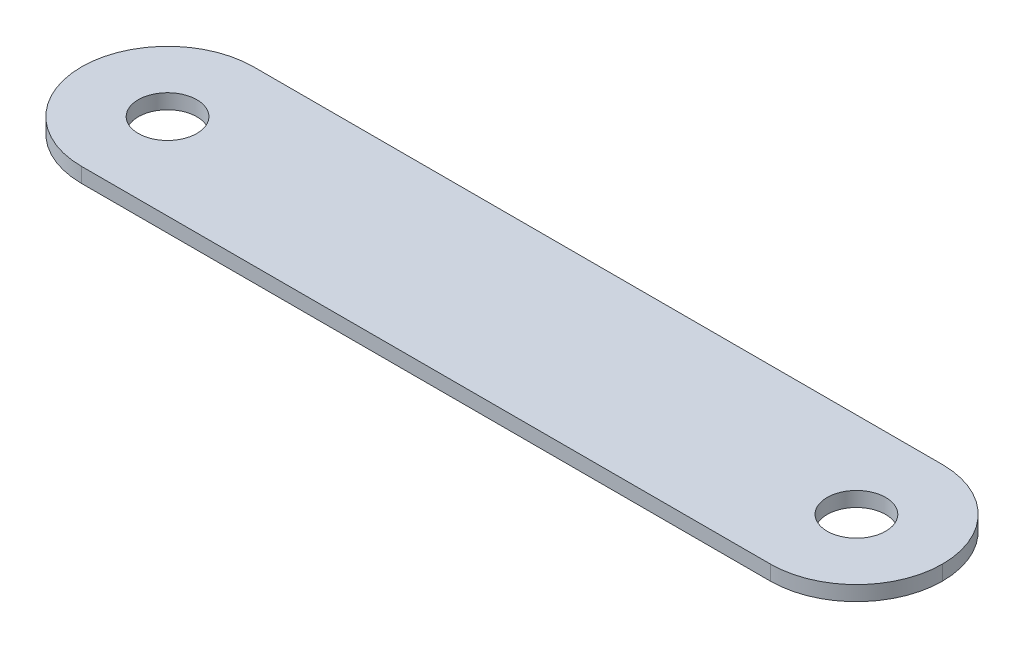
ISO-10303-21;
HEADER;
FILE_DESCRIPTION(('STEP AP214'),'2;1');
FILE_NAME('part.step','',(''),(''),'','','');
FILE_SCHEMA(('AUTOMOTIVE_DESIGN { 1 0 10303 214 1 1 1 1 }'));
ENDSEC;
DATA;
#1=APPLICATION_CONTEXT('core data for automotive mechanical design processes');
#2=APPLICATION_PROTOCOL_DEFINITION('international standard','automotive_design',2000,#1);
#3=PRODUCT_CONTEXT('',#1,'mechanical');
#4=PRODUCT('Part','Part','',(#3));
#5=PRODUCT_RELATED_PRODUCT_CATEGORY('part','',(#4));
#6=PRODUCT_DEFINITION_FORMATION('','',#4);
#7=PRODUCT_DEFINITION_CONTEXT('part definition',#1,'design');
#8=PRODUCT_DEFINITION('design','',#6,#7);
#9=PRODUCT_DEFINITION_SHAPE('','',#8);
#10=(LENGTH_UNIT() NAMED_UNIT(*) SI_UNIT(.MILLI.,.METRE.));
#11=(NAMED_UNIT(*) PLANE_ANGLE_UNIT() SI_UNIT($,.RADIAN.));
#12=(NAMED_UNIT(*) SI_UNIT($,.STERADIAN.) SOLID_ANGLE_UNIT());
#13=UNCERTAINTY_MEASURE_WITH_UNIT(LENGTH_MEASURE(1.E-05),#10,'distance_accuracy_value','');
#14=(GEOMETRIC_REPRESENTATION_CONTEXT(3) GLOBAL_UNCERTAINTY_ASSIGNED_CONTEXT((#13)) GLOBAL_UNIT_ASSIGNED_CONTEXT((#10,
#11,#12)) REPRESENTATION_CONTEXT('',''));
#15=CARTESIAN_POINT('',(0.,0.,0.));
#16=DIRECTION('',(0.,0.,1.));
#17=DIRECTION('',(1.,0.,0.));
#18=AXIS2_PLACEMENT_3D('',#15,#16,#17);
#19=CARTESIAN_POINT('',(25.,-0.86,-5.));
#20=DIRECTION('',(0.,0.,-1.));
#21=DIRECTION('',(-1.,0.,0.));
#22=AXIS2_PLACEMENT_3D('',#19,#20,#21);
#23=PLANE('',#22);
#24=DIRECTION('',(-1.,0.,0.));
#25=VECTOR('',#24,1.);
#26=CARTESIAN_POINT('',(25.,0.,-5.));
#27=LINE('',#26,#25);
#28=CARTESIAN_POINT('',(20.,0.,-5.));
#29=VERTEX_POINT('',#28);
#30=CARTESIAN_POINT('',(-20.,0.,-5.));
#31=VERTEX_POINT('',#30);
#32=EDGE_CURVE('E109',#29,#31,#27,.T.);
#33=ORIENTED_EDGE('',*,*,#32,.F.);
#34=DIRECTION('',(0.,1.,0.));
#35=VECTOR('',#34,1.);
#36=CARTESIAN_POINT('',(20.,-0.86,-5.));
#37=LINE('',#36,#35);
#38=CARTESIAN_POINT('',(20.,-0.86,-5.));
#39=VERTEX_POINT('',#38);
#40=EDGE_CURVE('E11',#29,#39,#37,.F.);
#41=ORIENTED_EDGE('',*,*,#40,.T.);
#42=DIRECTION('',(-1.,0.,0.));
#43=VECTOR('',#42,1.);
#44=CARTESIAN_POINT('',(25.,-0.86,-5.));
#45=LINE('',#44,#43);
#46=CARTESIAN_POINT('',(-20.,-0.86,-5.));
#47=VERTEX_POINT('',#46);
#48=EDGE_CURVE('E114',#39,#47,#45,.T.);
#49=ORIENTED_EDGE('',*,*,#48,.T.);
#50=DIRECTION('',(0.,1.,0.));
#51=VECTOR('',#50,1.);
#52=CARTESIAN_POINT('',(-20.,-0.86,-5.));
#53=LINE('',#52,#51);
#54=EDGE_CURVE('E45',#47,#31,#53,.T.);
#55=ORIENTED_EDGE('',*,*,#54,.T.);
#56=EDGE_LOOP('',(#33,#41,#49,#55));
#57=FACE_BOUND('',#56,.T.);
#58=ADVANCED_FACE('F36',(#57),#23,.T.);
#59=CARTESIAN_POINT('',(25.,-0.86,4.99999999999999));
#60=DIRECTION('',(0.,0.,1.));
#61=DIRECTION('',(1.,0.,0.));
#62=AXIS2_PLACEMENT_3D('',#59,#60,#61);
#63=PLANE('',#62);
#64=DIRECTION('',(1.,0.,0.));
#65=VECTOR('',#64,1.);
#66=CARTESIAN_POINT('',(25.,-0.86,4.99999999999999));
#67=LINE('',#66,#65);
#68=CARTESIAN_POINT('',(-20.,-0.86,5.));
#69=VERTEX_POINT('',#68);
#70=CARTESIAN_POINT('',(20.,-0.86,4.99999999999999));
#71=VERTEX_POINT('',#70);
#72=EDGE_CURVE('E117',#69,#71,#67,.T.);
#73=ORIENTED_EDGE('',*,*,#72,.T.);
#74=DIRECTION('',(0.,1.,0.));
#75=VECTOR('',#74,1.);
#76=CARTESIAN_POINT('',(20.,-0.86,4.99999999999999));
#77=LINE('',#76,#75);
#78=CARTESIAN_POINT('',(20.,0.,4.99999999999999));
#79=VERTEX_POINT('',#78);
#80=EDGE_CURVE('E100',#71,#79,#77,.T.);
#81=ORIENTED_EDGE('',*,*,#80,.T.);
#82=DIRECTION('',(1.,0.,0.));
#83=VECTOR('',#82,1.);
#84=CARTESIAN_POINT('',(25.,0.,4.99999999999999));
#85=LINE('',#84,#83);
#86=CARTESIAN_POINT('',(-20.,0.,5.));
#87=VERTEX_POINT('',#86);
#88=EDGE_CURVE('E93',#87,#79,#85,.T.);
#89=ORIENTED_EDGE('',*,*,#88,.F.);
#90=DIRECTION('',(0.,1.,0.));
#91=VECTOR('',#90,1.);
#92=CARTESIAN_POINT('',(-20.,-0.86,5.));
#93=LINE('',#92,#91);
#94=EDGE_CURVE('E106',#87,#69,#93,.F.);
#95=ORIENTED_EDGE('',*,*,#94,.T.);
#96=EDGE_LOOP('',(#73,#81,#89,#95));
#97=FACE_BOUND('',#96,.T.);
#98=ADVANCED_FACE('F105',(#97),#63,.T.);
#99=CARTESIAN_POINT('',(0.,-0.86,0.));
#100=DIRECTION('',(0.,1.,0.));
#101=DIRECTION('',(0.,0.,1.));
#102=AXIS2_PLACEMENT_3D('',#99,#100,#101);
#103=PLANE('',#102);
#104=CARTESIAN_POINT('',(-20.,-0.86,0.));
#105=DIRECTION('',(0.,1.,0.));
#106=DIRECTION('',(0.,0.,1.));
#107=AXIS2_PLACEMENT_3D('',#104,#105,#106);
#108=CIRCLE('',#107,1.69999999999999);
#109=CARTESIAN_POINT('',(-20.,-0.86,1.69999999999999));
#110=VERTEX_POINT('',#109);
#111=EDGE_CURVE('E138',#110,#110,#108,.T.);
#112=ORIENTED_EDGE('',*,*,#111,.T.);
#113=EDGE_LOOP('',(#112));
#114=FACE_BOUND('',#113,.T.);
#115=CARTESIAN_POINT('',(20.,-0.86,0.));
#116=DIRECTION('',(0.,1.,0.));
#117=DIRECTION('',(0.,0.,1.));
#118=AXIS2_PLACEMENT_3D('',#115,#116,#117);
#119=CIRCLE('',#118,1.69999999999999);
#120=CARTESIAN_POINT('',(20.,-0.86,1.69999999999999));
#121=VERTEX_POINT('',#120);
#122=EDGE_CURVE('E110',#121,#121,#119,.T.);
#123=ORIENTED_EDGE('',*,*,#122,.T.);
#124=EDGE_LOOP('',(#123));
#125=FACE_BOUND('',#124,.T.);
#126=CARTESIAN_POINT('',(20.,-0.86,0.));
#127=DIRECTION('',(0.,1.,0.));
#128=DIRECTION('',(0.,0.,1.));
#129=AXIS2_PLACEMENT_3D('',#126,#127,#128);
#130=CIRCLE('',#129,5.);
#131=CARTESIAN_POINT('',(25.,-0.86,0.));
#132=VERTEX_POINT('',#131);
#133=EDGE_CURVE('E53',#39,#132,#130,.F.);
#134=ORIENTED_EDGE('',*,*,#133,.T.);
#135=CARTESIAN_POINT('',(20.,-0.86,0.));
#136=DIRECTION('',(0.,1.,0.));
#137=DIRECTION('',(0.,0.,1.));
#138=AXIS2_PLACEMENT_3D('',#135,#136,#137);
#139=CIRCLE('',#138,5.);
#140=EDGE_CURVE('E129',#132,#71,#139,.F.);
#141=ORIENTED_EDGE('',*,*,#140,.T.);
#142=ORIENTED_EDGE('',*,*,#72,.F.);
#143=CARTESIAN_POINT('',(-20.,-0.86,0.));
#144=DIRECTION('',(0.,1.,0.));
#145=DIRECTION('',(0.,0.,1.));
#146=AXIS2_PLACEMENT_3D('',#143,#144,#145);
#147=CIRCLE('',#146,5.);
#148=CARTESIAN_POINT('',(-25.,-0.86,0.));
#149=VERTEX_POINT('',#148);
#150=EDGE_CURVE('E113',#69,#149,#147,.F.);
#151=ORIENTED_EDGE('',*,*,#150,.T.);
#152=CARTESIAN_POINT('',(-20.,-0.86,0.));
#153=DIRECTION('',(0.,1.,0.));
#154=DIRECTION('',(0.,0.,1.));
#155=AXIS2_PLACEMENT_3D('',#152,#153,#154);
#156=CIRCLE('',#155,5.);
#157=EDGE_CURVE('E59',#149,#47,#156,.F.);
#158=ORIENTED_EDGE('',*,*,#157,.T.);
#159=ORIENTED_EDGE('',*,*,#48,.F.);
#160=EDGE_LOOP('',(#134,#141,#142,#151,#158,#159));
#161=FACE_BOUND('',#160,.T.);
#162=ADVANCED_FACE('F157',(#114,#125,#161),#103,.F.);
#163=CARTESIAN_POINT('',(0.,0.,0.));
#164=DIRECTION('',(0.,1.,0.));
#165=DIRECTION('',(0.,0.,1.));
#166=AXIS2_PLACEMENT_3D('',#163,#164,#165);
#167=PLANE('',#166);
#168=CARTESIAN_POINT('',(-20.,0.,0.));
#169=DIRECTION('',(0.,1.,0.));
#170=DIRECTION('',(0.,0.,1.));
#171=AXIS2_PLACEMENT_3D('',#168,#169,#170);
#172=CIRCLE('',#171,1.69999999999999);
#173=CARTESIAN_POINT('',(-20.,0.,1.69999999999999));
#174=VERTEX_POINT('',#173);
#175=EDGE_CURVE('E134',#174,#174,#172,.T.);
#176=ORIENTED_EDGE('',*,*,#175,.F.);
#177=EDGE_LOOP('',(#176));
#178=FACE_BOUND('',#177,.T.);
#179=CARTESIAN_POINT('',(20.,0.,0.));
#180=DIRECTION('',(0.,1.,0.));
#181=DIRECTION('',(0.,0.,1.));
#182=AXIS2_PLACEMENT_3D('',#179,#180,#181);
#183=CIRCLE('',#182,1.69999999999999);
#184=CARTESIAN_POINT('',(20.,0.,1.69999999999999));
#185=VERTEX_POINT('',#184);
#186=EDGE_CURVE('E151',#185,#185,#183,.T.);
#187=ORIENTED_EDGE('',*,*,#186,.F.);
#188=EDGE_LOOP('',(#187));
#189=FACE_BOUND('',#188,.T.);
#190=ORIENTED_EDGE('',*,*,#88,.T.);
#191=CARTESIAN_POINT('',(20.,0.,0.));
#192=DIRECTION('',(0.,1.,0.));
#193=DIRECTION('',(0.,0.,1.));
#194=AXIS2_PLACEMENT_3D('',#191,#192,#193);
#195=CIRCLE('',#194,5.);
#196=CARTESIAN_POINT('',(25.,0.,0.));
#197=VERTEX_POINT('',#196);
#198=EDGE_CURVE('E124',#79,#197,#195,.T.);
#199=ORIENTED_EDGE('',*,*,#198,.T.);
#200=CARTESIAN_POINT('',(20.,0.,0.));
#201=DIRECTION('',(0.,1.,0.));
#202=DIRECTION('',(0.,0.,1.));
#203=AXIS2_PLACEMENT_3D('',#200,#201,#202);
#204=CIRCLE('',#203,5.);
#205=EDGE_CURVE('E122',#197,#29,#204,.T.);
#206=ORIENTED_EDGE('',*,*,#205,.T.);
#207=ORIENTED_EDGE('',*,*,#32,.T.);
#208=CARTESIAN_POINT('',(-20.,0.,0.));
#209=DIRECTION('',(0.,1.,0.));
#210=DIRECTION('',(0.,0.,1.));
#211=AXIS2_PLACEMENT_3D('',#208,#209,#210);
#212=CIRCLE('',#211,5.);
#213=CARTESIAN_POINT('',(-25.,0.,0.));
#214=VERTEX_POINT('',#213);
#215=EDGE_CURVE('E95',#31,#214,#212,.T.);
#216=ORIENTED_EDGE('',*,*,#215,.T.);
#217=CARTESIAN_POINT('',(-20.,0.,0.));
#218=DIRECTION('',(0.,1.,0.));
#219=DIRECTION('',(0.,0.,1.));
#220=AXIS2_PLACEMENT_3D('',#217,#218,#219);
#221=CIRCLE('',#220,5.);
#222=EDGE_CURVE('E90',#214,#87,#221,.T.);
#223=ORIENTED_EDGE('',*,*,#222,.T.);
#224=EDGE_LOOP('',(#190,#199,#206,#207,#216,#223));
#225=FACE_BOUND('',#224,.T.);
#226=ADVANCED_FACE('F92',(#178,#189,#225),#167,.T.);
#227=CARTESIAN_POINT('',(20.,0.,0.));
#228=DIRECTION('',(0.,1.,0.));
#229=DIRECTION('',(0.,0.,1.));
#230=AXIS2_PLACEMENT_3D('',#227,#228,#229);
#231=CYLINDRICAL_SURFACE('',#230,1.69999999999999);
#232=ORIENTED_EDGE('',*,*,#186,.T.);
#233=EDGE_LOOP('',(#232));
#234=FACE_BOUND('',#233,.T.);
#235=ORIENTED_EDGE('',*,*,#122,.F.);
#236=EDGE_LOOP('',(#235));
#237=FACE_BOUND('',#236,.T.);
#238=ADVANCED_FACE('F163',(#234,#237),#231,.F.);
#239=CARTESIAN_POINT('',(-20.,0.,0.));
#240=DIRECTION('',(0.,1.,0.));
#241=DIRECTION('',(0.,0.,1.));
#242=AXIS2_PLACEMENT_3D('',#239,#240,#241);
#243=CYLINDRICAL_SURFACE('',#242,1.69999999999999);
#244=ORIENTED_EDGE('',*,*,#175,.T.);
#245=EDGE_LOOP('',(#244));
#246=FACE_BOUND('',#245,.T.);
#247=ORIENTED_EDGE('',*,*,#111,.F.);
#248=EDGE_LOOP('',(#247));
#249=FACE_BOUND('',#248,.T.);
#250=ADVANCED_FACE('F160',(#246,#249),#243,.F.);
#251=CARTESIAN_POINT('',(20.,-0.86,0.));
#252=DIRECTION('',(0.,1.,0.));
#253=DIRECTION('',(0.,0.,1.));
#254=AXIS2_PLACEMENT_3D('',#251,#252,#253);
#255=CYLINDRICAL_SURFACE('',#254,5.);
#256=DIRECTION('',(0.,1.,0.));
#257=VECTOR('',#256,1.);
#258=CARTESIAN_POINT('',(25.,-0.86,0.));
#259=LINE('',#258,#257);
#260=EDGE_CURVE('E132',#132,#197,#259,.T.);
#261=ORIENTED_EDGE('',*,*,#260,.F.);
#262=ORIENTED_EDGE('',*,*,#133,.F.);
#263=ORIENTED_EDGE('',*,*,#40,.F.);
#264=ORIENTED_EDGE('',*,*,#205,.F.);
#265=EDGE_LOOP('',(#261,#262,#263,#264));
#266=FACE_BOUND('',#265,.T.);
#267=ADVANCED_FACE('F162',(#266),#255,.T.);
#268=CARTESIAN_POINT('',(20.,-0.86,0.));
#269=DIRECTION('',(0.,1.,0.));
#270=DIRECTION('',(0.,0.,1.));
#271=AXIS2_PLACEMENT_3D('',#268,#269,#270);
#272=CYLINDRICAL_SURFACE('',#271,5.);
#273=ORIENTED_EDGE('',*,*,#140,.F.);
#274=ORIENTED_EDGE('',*,*,#260,.T.);
#275=ORIENTED_EDGE('',*,*,#198,.F.);
#276=ORIENTED_EDGE('',*,*,#80,.F.);
#277=EDGE_LOOP('',(#273,#274,#275,#276));
#278=FACE_BOUND('',#277,.T.);
#279=ADVANCED_FACE('F170',(#278),#272,.T.);
#280=CARTESIAN_POINT('',(-20.,-0.86,0.));
#281=DIRECTION('',(0.,1.,0.));
#282=DIRECTION('',(0.,0.,1.));
#283=AXIS2_PLACEMENT_3D('',#280,#281,#282);
#284=CYLINDRICAL_SURFACE('',#283,5.);
#285=DIRECTION('',(0.,1.,0.));
#286=VECTOR('',#285,1.);
#287=CARTESIAN_POINT('',(-25.,-0.86,0.));
#288=LINE('',#287,#286);
#289=EDGE_CURVE('E40',#149,#214,#288,.T.);
#290=ORIENTED_EDGE('',*,*,#289,.F.);
#291=ORIENTED_EDGE('',*,*,#150,.F.);
#292=ORIENTED_EDGE('',*,*,#94,.F.);
#293=ORIENTED_EDGE('',*,*,#222,.F.);
#294=EDGE_LOOP('',(#290,#291,#292,#293));
#295=FACE_BOUND('',#294,.T.);
#296=ADVANCED_FACE('F38',(#295),#284,.T.);
#297=CARTESIAN_POINT('',(-20.,-0.86,0.));
#298=DIRECTION('',(0.,1.,0.));
#299=DIRECTION('',(0.,0.,1.));
#300=AXIS2_PLACEMENT_3D('',#297,#298,#299);
#301=CYLINDRICAL_SURFACE('',#300,5.);
#302=ORIENTED_EDGE('',*,*,#157,.F.);
#303=ORIENTED_EDGE('',*,*,#289,.T.);
#304=ORIENTED_EDGE('',*,*,#215,.F.);
#305=ORIENTED_EDGE('',*,*,#54,.F.);
#306=EDGE_LOOP('',(#302,#303,#304,#305));
#307=FACE_BOUND('',#306,.T.);
#308=ADVANCED_FACE('F141',(#307),#301,.T.);
#309=CLOSED_SHELL('',(#58,#98,#162,#226,#238,#250,#267,#279,#296,#308));
#310=MANIFOLD_SOLID_BREP('B2',#309);
#311=ADVANCED_BREP_SHAPE_REPRESENTATION('',(#18,#310),#14);
#312=SHAPE_DEFINITION_REPRESENTATION(#9,#311);
ENDSEC;
END-ISO-10303-21;
